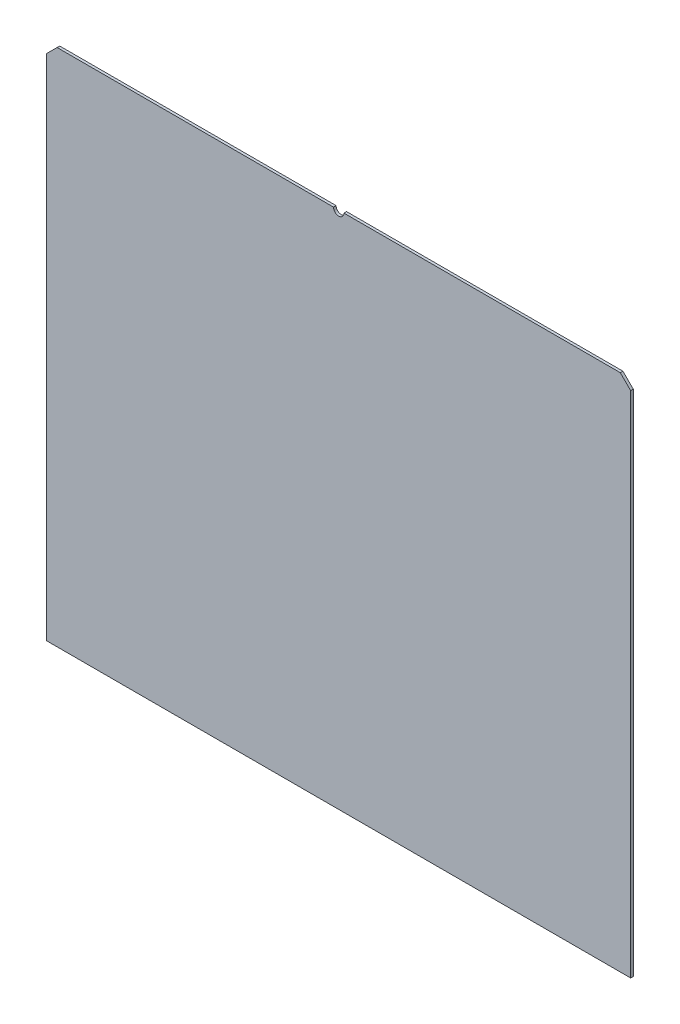
ISO-10303-21;
HEADER;
FILE_DESCRIPTION(('STEP AP214'),'2;1');
FILE_NAME('part.step','',(''),(''),'','','');
FILE_SCHEMA(('AUTOMOTIVE_DESIGN { 1 0 10303 214 1 1 1 1 }'));
ENDSEC;
DATA;
#1=APPLICATION_CONTEXT('core data for automotive mechanical design processes');
#2=APPLICATION_PROTOCOL_DEFINITION('international standard','automotive_design',2000,#1);
#3=PRODUCT_CONTEXT('',#1,'mechanical');
#4=PRODUCT('Part','Part','',(#3));
#5=PRODUCT_RELATED_PRODUCT_CATEGORY('part','',(#4));
#6=PRODUCT_DEFINITION_FORMATION('','',#4);
#7=PRODUCT_DEFINITION_CONTEXT('part definition',#1,'design');
#8=PRODUCT_DEFINITION('design','',#6,#7);
#9=PRODUCT_DEFINITION_SHAPE('','',#8);
#10=(LENGTH_UNIT() NAMED_UNIT(*) SI_UNIT(.MILLI.,.METRE.));
#11=(NAMED_UNIT(*) PLANE_ANGLE_UNIT() SI_UNIT($,.RADIAN.));
#12=(NAMED_UNIT(*) SI_UNIT($,.STERADIAN.) SOLID_ANGLE_UNIT());
#13=UNCERTAINTY_MEASURE_WITH_UNIT(LENGTH_MEASURE(1.E-05),#10,'distance_accuracy_value','');
#14=(GEOMETRIC_REPRESENTATION_CONTEXT(3) GLOBAL_UNCERTAINTY_ASSIGNED_CONTEXT((#13)) GLOBAL_UNIT_ASSIGNED_CONTEXT((#10,
#11,#12)) REPRESENTATION_CONTEXT('',''));
#15=CARTESIAN_POINT('',(0.,0.,0.));
#16=DIRECTION('',(0.,0.,1.));
#17=DIRECTION('',(1.,0.,0.));
#18=AXIS2_PLACEMENT_3D('',#15,#16,#17);
#19=CARTESIAN_POINT('',(0.,200.,0.));
#20=DIRECTION('',(0.,-1.,0.));
#21=DIRECTION('',(-1.,0.,0.));
#22=AXIS2_PLACEMENT_3D('',#19,#20,#21);
#23=PLANE('',#22);
#24=DIRECTION('',(1.,0.,0.));
#25=VECTOR('',#24,1.);
#26=CARTESIAN_POINT('',(-112.5,200.,1.));
#27=LINE('',#26,#25);
#28=CARTESIAN_POINT('',(-108.5,200.,0.999999999999999));
#29=VERTEX_POINT('',#28);
#30=CARTESIAN_POINT('',(-2.,200.,1.00000000000002));
#31=VERTEX_POINT('',#30);
#32=EDGE_CURVE('E111',#29,#31,#27,.T.);
#33=ORIENTED_EDGE('',*,*,#32,.T.);
#34=DIRECTION('',(0.,0.,-1.));
#35=VECTOR('',#34,1.);
#36=CARTESIAN_POINT('',(-2.,200.,1.00000000000002));
#37=LINE('',#36,#35);
#38=CARTESIAN_POINT('',(-2.,200.,0.));
#39=VERTEX_POINT('',#38);
#40=EDGE_CURVE('E11',#31,#39,#37,.T.);
#41=ORIENTED_EDGE('',*,*,#40,.T.);
#42=DIRECTION('',(1.,0.,0.));
#43=VECTOR('',#42,1.);
#44=CARTESIAN_POINT('',(-112.5,200.,0.));
#45=LINE('',#44,#43);
#46=CARTESIAN_POINT('',(-108.5,200.,0.));
#47=VERTEX_POINT('',#46);
#48=EDGE_CURVE('E108',#47,#39,#45,.T.);
#49=ORIENTED_EDGE('',*,*,#48,.F.);
#50=DIRECTION('',(0.,0.,1.));
#51=VECTOR('',#50,1.);
#52=CARTESIAN_POINT('',(-108.5,200.,1.));
#53=LINE('',#52,#51);
#54=EDGE_CURVE('E149',#47,#29,#53,.T.);
#55=ORIENTED_EDGE('',*,*,#54,.T.);
#56=EDGE_LOOP('',(#33,#41,#49,#55));
#57=FACE_BOUND('',#56,.T.);
#58=ADVANCED_FACE('F34',(#57),#23,.F.);
#59=CARTESIAN_POINT('',(-112.5,200.,1.));
#60=DIRECTION('',(0.,0.,-1.));
#61=DIRECTION('',(-1.,0.,0.));
#62=AXIS2_PLACEMENT_3D('',#59,#60,#61);
#63=PLANE('',#62);
#64=CARTESIAN_POINT('',(2.,200.,0.999999999999979));
#65=VERTEX_POINT('',#64);
#66=CARTESIAN_POINT('',(108.5,200.,0.999999999999959));
#67=VERTEX_POINT('',#66);
#68=EDGE_CURVE('E133',#65,#67,#27,.T.);
#69=ORIENTED_EDGE('',*,*,#68,.F.);
#70=CARTESIAN_POINT('',(0.,200.,1.00000000000002));
#71=DIRECTION('',(0.,0.,-1.));
#72=DIRECTION('',(-1.,0.,0.));
#73=AXIS2_PLACEMENT_3D('',#70,#71,#72);
#74=CIRCLE('',#73,2.);
#75=EDGE_CURVE('E49',#65,#31,#74,.T.);
#76=ORIENTED_EDGE('',*,*,#75,.T.);
#77=ORIENTED_EDGE('',*,*,#32,.F.);
#78=DIRECTION('',(-0.70710678118655,-0.707106781186545,0.));
#79=VECTOR('',#78,1.);
#80=CARTESIAN_POINT('',(-112.5,196.,1.));
#81=LINE('',#80,#79);
#82=CARTESIAN_POINT('',(-112.5,196.,1.));
#83=VERTEX_POINT('',#82);
#84=EDGE_CURVE('E152',#29,#83,#81,.T.);
#85=ORIENTED_EDGE('',*,*,#84,.T.);
#86=DIRECTION('',(0.,-1.,0.));
#87=VECTOR('',#86,1.);
#88=CARTESIAN_POINT('',(-112.5,200.,1.));
#89=LINE('',#88,#87);
#90=CARTESIAN_POINT('',(-112.5,0.,1.));
#91=VERTEX_POINT('',#90);
#92=EDGE_CURVE('E115',#83,#91,#89,.T.);
#93=ORIENTED_EDGE('',*,*,#92,.T.);
#94=DIRECTION('',(1.,0.,0.));
#95=VECTOR('',#94,1.);
#96=CARTESIAN_POINT('',(-112.5,0.,1.));
#97=LINE('',#96,#95);
#98=CARTESIAN_POINT('',(112.5,0.,0.999999999999959));
#99=VERTEX_POINT('',#98);
#100=EDGE_CURVE('E122',#91,#99,#97,.T.);
#101=ORIENTED_EDGE('',*,*,#100,.T.);
#102=DIRECTION('',(0.,-1.,0.));
#103=VECTOR('',#102,1.);
#104=CARTESIAN_POINT('',(112.5,200.,0.999999999999959));
#105=LINE('',#104,#103);
#106=CARTESIAN_POINT('',(112.5,196.,0.999999999999959));
#107=VERTEX_POINT('',#106);
#108=EDGE_CURVE('E138',#107,#99,#105,.T.);
#109=ORIENTED_EDGE('',*,*,#108,.F.);
#110=DIRECTION('',(-0.70710678118655,0.707106781186545,0.));
#111=VECTOR('',#110,1.);
#112=CARTESIAN_POINT('',(112.5,196.,0.999999999999959));
#113=LINE('',#112,#111);
#114=EDGE_CURVE('E57',#107,#67,#113,.T.);
#115=ORIENTED_EDGE('',*,*,#114,.T.);
#116=EDGE_LOOP('',(#69,#76,#77,#85,#93,#101,#109,#115));
#117=FACE_BOUND('',#116,.T.);
#118=ADVANCED_FACE('F159',(#117),#63,.F.);
#119=CARTESIAN_POINT('',(112.5,200.,0.));
#120=DIRECTION('',(1.,0.,0.));
#121=DIRECTION('',(0.,0.,-1.));
#122=AXIS2_PLACEMENT_3D('',#119,#120,#121);
#123=PLANE('',#122);
#124=DIRECTION('',(0.,-1.,0.));
#125=VECTOR('',#124,1.);
#126=CARTESIAN_POINT('',(112.5,200.,0.));
#127=LINE('',#126,#125);
#128=CARTESIAN_POINT('',(112.5,196.,0.));
#129=VERTEX_POINT('',#128);
#130=CARTESIAN_POINT('',(112.5,0.,0.));
#131=VERTEX_POINT('',#130);
#132=EDGE_CURVE('E136',#129,#131,#127,.T.);
#133=ORIENTED_EDGE('',*,*,#132,.F.);
#134=DIRECTION('',(0.,0.,1.));
#135=VECTOR('',#134,1.);
#136=CARTESIAN_POINT('',(112.5,196.,0.999999999999959));
#137=LINE('',#136,#135);
#138=EDGE_CURVE('E154',#129,#107,#137,.T.);
#139=ORIENTED_EDGE('',*,*,#138,.T.);
#140=ORIENTED_EDGE('',*,*,#108,.T.);
#141=DIRECTION('',(0.,0.,1.));
#142=VECTOR('',#141,1.);
#143=CARTESIAN_POINT('',(112.5,0.,0.));
#144=LINE('',#143,#142);
#145=EDGE_CURVE('E125',#131,#99,#144,.T.);
#146=ORIENTED_EDGE('',*,*,#145,.F.);
#147=EDGE_LOOP('',(#133,#139,#140,#146));
#148=FACE_BOUND('',#147,.T.);
#149=ADVANCED_FACE('F166',(#148),#123,.T.);
#150=CARTESIAN_POINT('',(-112.5,200.,0.));
#151=DIRECTION('',(0.,0.,-1.));
#152=DIRECTION('',(-1.,0.,0.));
#153=AXIS2_PLACEMENT_3D('',#150,#151,#152);
#154=PLANE('',#153);
#155=CARTESIAN_POINT('',(0.,200.,0.));
#156=DIRECTION('',(0.,0.,-1.));
#157=DIRECTION('',(-1.,0.,0.));
#158=AXIS2_PLACEMENT_3D('',#155,#156,#157);
#159=CIRCLE('',#158,2.);
#160=CARTESIAN_POINT('',(2.,200.,0.));
#161=VERTEX_POINT('',#160);
#162=EDGE_CURVE('E99',#161,#39,#159,.T.);
#163=ORIENTED_EDGE('',*,*,#162,.F.);
#164=CARTESIAN_POINT('',(108.5,200.,0.));
#165=VERTEX_POINT('',#164);
#166=EDGE_CURVE('E116',#161,#165,#45,.T.);
#167=ORIENTED_EDGE('',*,*,#166,.T.);
#168=DIRECTION('',(0.70710678118655,-0.707106781186545,0.));
#169=VECTOR('',#168,1.);
#170=CARTESIAN_POINT('',(-2.00000000000077,310.5,0.));
#171=LINE('',#170,#169);
#172=EDGE_CURVE('E143',#165,#129,#171,.T.);
#173=ORIENTED_EDGE('',*,*,#172,.T.);
#174=ORIENTED_EDGE('',*,*,#132,.T.);
#175=DIRECTION('',(1.,0.,0.));
#176=VECTOR('',#175,1.);
#177=CARTESIAN_POINT('',(-112.5,0.,0.));
#178=LINE('',#177,#176);
#179=CARTESIAN_POINT('',(-112.5,0.,0.));
#180=VERTEX_POINT('',#179);
#181=EDGE_CURVE('E128',#180,#131,#178,.T.);
#182=ORIENTED_EDGE('',*,*,#181,.F.);
#183=DIRECTION('',(0.,-1.,0.));
#184=VECTOR('',#183,1.);
#185=CARTESIAN_POINT('',(-112.5,200.,0.));
#186=LINE('',#185,#184);
#187=CARTESIAN_POINT('',(-112.5,196.,0.));
#188=VERTEX_POINT('',#187);
#189=EDGE_CURVE('E118',#188,#180,#186,.T.);
#190=ORIENTED_EDGE('',*,*,#189,.F.);
#191=DIRECTION('',(0.70710678118655,0.707106781186545,0.));
#192=VECTOR('',#191,1.);
#193=CARTESIAN_POINT('',(-110.5,198.,0.));
#194=LINE('',#193,#192);
#195=EDGE_CURVE('E114',#188,#47,#194,.T.);
#196=ORIENTED_EDGE('',*,*,#195,.T.);
#197=ORIENTED_EDGE('',*,*,#48,.T.);
#198=EDGE_LOOP('',(#163,#167,#173,#174,#182,#190,#196,#197));
#199=FACE_BOUND('',#198,.T.);
#200=ADVANCED_FACE('F112',(#199),#154,.T.);
#201=CARTESIAN_POINT('',(-112.5,200.,1.));
#202=DIRECTION('',(-1.,0.,0.));
#203=DIRECTION('',(0.,0.,1.));
#204=AXIS2_PLACEMENT_3D('',#201,#202,#203);
#205=PLANE('',#204);
#206=ORIENTED_EDGE('',*,*,#92,.F.);
#207=DIRECTION('',(0.,0.,-1.));
#208=VECTOR('',#207,1.);
#209=CARTESIAN_POINT('',(-112.5,196.,0.));
#210=LINE('',#209,#208);
#211=EDGE_CURVE('E140',#83,#188,#210,.T.);
#212=ORIENTED_EDGE('',*,*,#211,.T.);
#213=ORIENTED_EDGE('',*,*,#189,.T.);
#214=DIRECTION('',(0.,0.,-1.));
#215=VECTOR('',#214,1.);
#216=CARTESIAN_POINT('',(-112.5,0.,1.));
#217=LINE('',#216,#215);
#218=EDGE_CURVE('E131',#91,#180,#217,.T.);
#219=ORIENTED_EDGE('',*,*,#218,.F.);
#220=EDGE_LOOP('',(#206,#212,#213,#219));
#221=FACE_BOUND('',#220,.T.);
#222=ADVANCED_FACE('F173',(#221),#205,.T.);
#223=ORIENTED_EDGE('',*,*,#166,.F.);
#224=DIRECTION('',(0.,0.,-1.));
#225=VECTOR('',#224,1.);
#226=CARTESIAN_POINT('',(2.,200.,1.00000000000002));
#227=LINE('',#226,#225);
#228=EDGE_CURVE('E42',#161,#65,#227,.F.);
#229=ORIENTED_EDGE('',*,*,#228,.T.);
#230=ORIENTED_EDGE('',*,*,#68,.T.);
#231=DIRECTION('',(0.,0.,-1.));
#232=VECTOR('',#231,1.);
#233=CARTESIAN_POINT('',(108.5,200.,0.));
#234=LINE('',#233,#232);
#235=EDGE_CURVE('E146',#67,#165,#234,.T.);
#236=ORIENTED_EDGE('',*,*,#235,.T.);
#237=EDGE_LOOP('',(#223,#229,#230,#236));
#238=FACE_BOUND('',#237,.T.);
#239=ADVANCED_FACE('F157',(#238),#23,.F.);
#240=CARTESIAN_POINT('',(0.,0.,0.));
#241=DIRECTION('',(0.,-1.,0.));
#242=DIRECTION('',(-1.,0.,0.));
#243=AXIS2_PLACEMENT_3D('',#240,#241,#242);
#244=PLANE('',#243);
#245=ORIENTED_EDGE('',*,*,#100,.F.);
#246=ORIENTED_EDGE('',*,*,#218,.T.);
#247=ORIENTED_EDGE('',*,*,#181,.T.);
#248=ORIENTED_EDGE('',*,*,#145,.T.);
#249=EDGE_LOOP('',(#245,#246,#247,#248));
#250=FACE_BOUND('',#249,.T.);
#251=ADVANCED_FACE('F169',(#250),#244,.T.);
#252=CARTESIAN_POINT('',(-112.5,196.,1.));
#253=DIRECTION('',(-0.707106781186545,0.70710678118655,0.));
#254=DIRECTION('',(0.,0.,1.));
#255=AXIS2_PLACEMENT_3D('',#252,#253,#254);
#256=PLANE('',#255);
#257=ORIENTED_EDGE('',*,*,#84,.F.);
#258=ORIENTED_EDGE('',*,*,#54,.F.);
#259=ORIENTED_EDGE('',*,*,#195,.F.);
#260=ORIENTED_EDGE('',*,*,#211,.F.);
#261=EDGE_LOOP('',(#257,#258,#259,#260));
#262=FACE_BOUND('',#261,.T.);
#263=ADVANCED_FACE('F177',(#262),#256,.T.);
#264=CARTESIAN_POINT('',(112.5,196.,0.));
#265=DIRECTION('',(0.707106781186545,0.70710678118655,0.));
#266=DIRECTION('',(0.,0.,-1.));
#267=AXIS2_PLACEMENT_3D('',#264,#265,#266);
#268=PLANE('',#267);
#269=ORIENTED_EDGE('',*,*,#172,.F.);
#270=ORIENTED_EDGE('',*,*,#235,.F.);
#271=ORIENTED_EDGE('',*,*,#114,.F.);
#272=ORIENTED_EDGE('',*,*,#138,.F.);
#273=EDGE_LOOP('',(#269,#270,#271,#272));
#274=FACE_BOUND('',#273,.T.);
#275=ADVANCED_FACE('F36',(#274),#268,.T.);
#276=CARTESIAN_POINT('',(0.,200.,1.00000000000002));
#277=DIRECTION('',(0.,0.,-1.));
#278=DIRECTION('',(-1.,0.,0.));
#279=AXIS2_PLACEMENT_3D('',#276,#277,#278);
#280=CYLINDRICAL_SURFACE('',#279,2.);
#281=ORIENTED_EDGE('',*,*,#75,.F.);
#282=ORIENTED_EDGE('',*,*,#228,.F.);
#283=ORIENTED_EDGE('',*,*,#162,.T.);
#284=ORIENTED_EDGE('',*,*,#40,.F.);
#285=EDGE_LOOP('',(#281,#282,#283,#284));
#286=FACE_BOUND('',#285,.T.);
#287=ADVANCED_FACE('F100',(#286),#280,.F.);
#288=CLOSED_SHELL('',(#58,#118,#149,#200,#222,#239,#251,#263,#275,#287));
#289=MANIFOLD_SOLID_BREP('B2',#288);
#290=ADVANCED_BREP_SHAPE_REPRESENTATION('',(#18,#289),#14);
#291=SHAPE_DEFINITION_REPRESENTATION(#9,#290);
ENDSEC;
END-ISO-10303-21;
